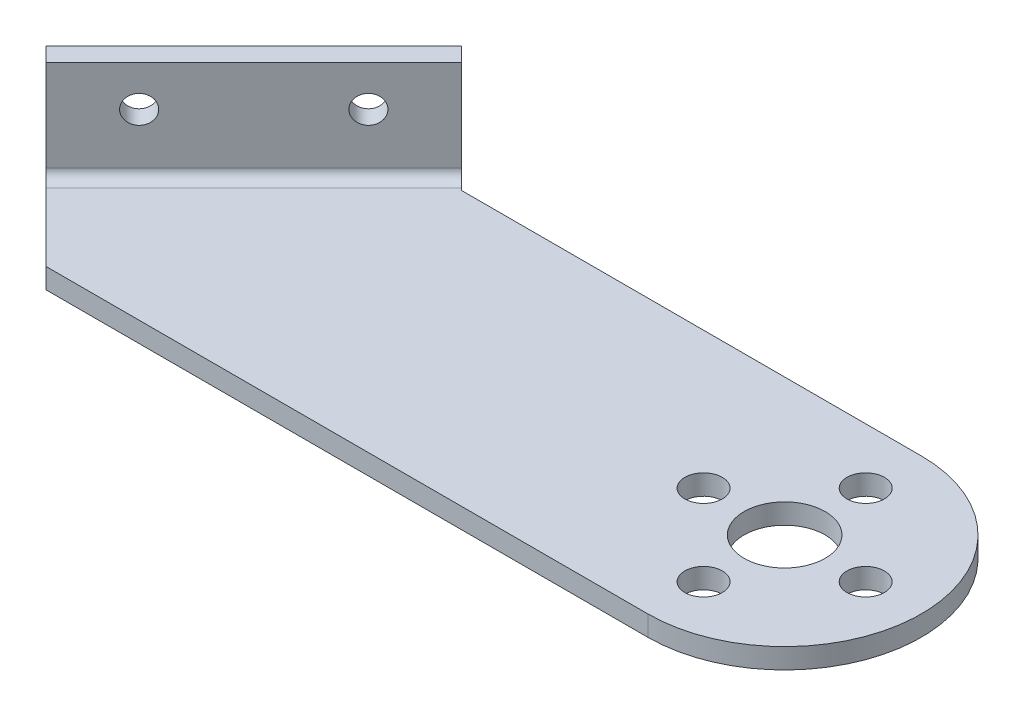
ISO-10303-21;
HEADER;
FILE_DESCRIPTION(('STEP AP214'),'2;1');
FILE_NAME('part.step','',(''),(''),'','','');
FILE_SCHEMA(('AUTOMOTIVE_DESIGN { 1 0 10303 214 1 1 1 1 }'));
ENDSEC;
DATA;
#1=APPLICATION_CONTEXT('core data for automotive mechanical design processes');
#2=APPLICATION_PROTOCOL_DEFINITION('international standard','automotive_design',2000,#1);
#3=PRODUCT_CONTEXT('',#1,'mechanical');
#4=PRODUCT('Part','Part','',(#3));
#5=PRODUCT_RELATED_PRODUCT_CATEGORY('part','',(#4));
#6=PRODUCT_DEFINITION_FORMATION('','',#4);
#7=PRODUCT_DEFINITION_CONTEXT('part definition',#1,'design');
#8=PRODUCT_DEFINITION('design','',#6,#7);
#9=PRODUCT_DEFINITION_SHAPE('','',#8);
#10=(LENGTH_UNIT() NAMED_UNIT(*) SI_UNIT(.MILLI.,.METRE.));
#11=(NAMED_UNIT(*) PLANE_ANGLE_UNIT() SI_UNIT($,.RADIAN.));
#12=(NAMED_UNIT(*) SI_UNIT($,.STERADIAN.) SOLID_ANGLE_UNIT());
#13=UNCERTAINTY_MEASURE_WITH_UNIT(LENGTH_MEASURE(1.E-05),#10,'distance_accuracy_value','');
#14=(GEOMETRIC_REPRESENTATION_CONTEXT(3) GLOBAL_UNCERTAINTY_ASSIGNED_CONTEXT((#13)) GLOBAL_UNIT_ASSIGNED_CONTEXT((#10,
#11,#12)) REPRESENTATION_CONTEXT('',''));
#15=CARTESIAN_POINT('',(0.,0.,0.));
#16=DIRECTION('',(0.,0.,1.));
#17=DIRECTION('',(1.,0.,0.));
#18=AXIS2_PLACEMENT_3D('',#15,#16,#17);
#19=CARTESIAN_POINT('',(13.7940246351911,8.,-9.12741699796952));
#20=DIRECTION('',(-0.707106781186548,0.,-0.707106781186547));
#21=DIRECTION('',(-0.707106781186548,0.,0.707106781186548));
#22=AXIS2_PLACEMENT_3D('',#19,#20,#21);
#23=CYLINDRICAL_SURFACE('',#22,1.36525);
#24=CARTESIAN_POINT('',(11.6727042916315,8.,-11.2487373415292));
#25=DIRECTION('',(-0.707106781186548,0.,-0.707106781186547));
#26=DIRECTION('',(-0.707106781186548,0.,0.707106781186548));
#27=AXIS2_PLACEMENT_3D('',#24,#25,#26);
#28=CIRCLE('',#27,1.36525);
#29=CARTESIAN_POINT('',(10.7073267586166,8.,-10.2833598085142));
#30=VERTEX_POINT('',#29);
#31=EDGE_CURVE('E153',#30,#30,#28,.T.);
#32=ORIENTED_EDGE('',*,*,#31,.T.);
#33=EDGE_LOOP('',(#32));
#34=FACE_BOUND('',#33,.T.);
#35=CARTESIAN_POINT('',(13.0869178540046,8.,-9.83452377915606));
#36=DIRECTION('',(-0.707106781186548,0.,-0.707106781186548));
#37=DIRECTION('',(-0.707106781186548,0.,0.707106781186548));
#38=AXIS2_PLACEMENT_3D('',#35,#36,#37);
#39=CIRCLE('',#38,1.36525);
#40=CARTESIAN_POINT('',(12.1215403209897,8.,-8.86914624614113));
#41=VERTEX_POINT('',#40);
#42=EDGE_CURVE('E195',#41,#41,#39,.T.);
#43=ORIENTED_EDGE('',*,*,#42,.F.);
#44=EDGE_LOOP('',(#43));
#45=FACE_BOUND('',#44,.T.);
#46=ADVANCED_FACE('F38',(#34,#45),#23,.F.);
#47=CARTESIAN_POINT('',(2.48031613620638,8.00000000000001,2.18629150101524));
#48=DIRECTION('',(-0.707106781186548,0.,-0.707106781186547));
#49=DIRECTION('',(-0.707106781186548,0.,0.707106781186548));
#50=AXIS2_PLACEMENT_3D('',#47,#48,#49);
#51=CYLINDRICAL_SURFACE('',#50,1.36525);
#52=CARTESIAN_POINT('',(0.358995792646737,8.00000000000001,0.0649711574556011));
#53=DIRECTION('',(-0.707106781186548,0.,-0.707106781186547));
#54=DIRECTION('',(-0.707106781186548,0.,0.707106781186548));
#55=AXIS2_PLACEMENT_3D('',#52,#53,#54);
#56=CIRCLE('',#55,1.36525);
#57=CARTESIAN_POINT('',(-0.606381740368197,8.00000000000001,1.03034869047054));
#58=VERTEX_POINT('',#57);
#59=EDGE_CURVE('E214',#58,#58,#56,.T.);
#60=ORIENTED_EDGE('',*,*,#59,.T.);
#61=EDGE_LOOP('',(#60));
#62=FACE_BOUND('',#61,.T.);
#63=CARTESIAN_POINT('',(1.77320935501983,8.00000000000001,1.4791847198287));
#64=DIRECTION('',(-0.707106781186548,0.,-0.707106781186548));
#65=DIRECTION('',(-0.707106781186548,0.,0.707106781186548));
#66=AXIS2_PLACEMENT_3D('',#63,#64,#65);
#67=CIRCLE('',#66,1.36525);
#68=CARTESIAN_POINT('',(0.8078318220049,8.00000000000001,2.44456225284363));
#69=VERTEX_POINT('',#68);
#70=EDGE_CURVE('E200',#69,#69,#67,.T.);
#71=ORIENTED_EDGE('',*,*,#70,.F.);
#72=EDGE_LOOP('',(#71));
#73=FACE_BOUND('',#72,.T.);
#74=ADVANCED_FACE('F233',(#62,#73),#51,.F.);
#75=CARTESIAN_POINT('',(70.0090137395217,12.,37.8951839509359));
#76=DIRECTION('',(0.,1.,0.));
#77=DIRECTION('',(-0.707106781186548,0.,0.707106781186548));
#78=AXIS2_PLACEMENT_3D('',#75,#76,#77);
#79=PLANE('',#78);
#80=DIRECTION('',(-0.707106781186548,0.,-0.707106781186548));
#81=VECTOR('',#80,1.);
#82=CARTESIAN_POINT('',(70.0090137395217,12.,37.8951839509359));
#83=LINE('',#82,#81);
#84=CARTESIAN_POINT('',(17.6831119317172,12.,-14.4307178568686));
#85=VERTEX_POINT('',#84);
#86=CARTESIAN_POINT('',(16.2688983693441,12.,-15.8449314192417));
#87=VERTEX_POINT('',#86);
#88=EDGE_CURVE('E212',#85,#87,#83,.T.);
#89=ORIENTED_EDGE('',*,*,#88,.T.);
#90=DIRECTION('',(-0.707106781186547,0.,0.707106781186547));
#91=VECTOR('',#90,1.);
#92=CARTESIAN_POINT('',(16.2688983693441,12.,-15.8449314192417));
#93=LINE('',#92,#91);
#94=CARTESIAN_POINT('',(-4.23719828506582,12.,4.66116523516816));
#95=VERTEX_POINT('',#94);
#96=EDGE_CURVE('E134',#87,#95,#93,.T.);
#97=ORIENTED_EDGE('',*,*,#96,.T.);
#98=DIRECTION('',(-0.707106781186548,0.,-0.707106781186548));
#99=VECTOR('',#98,1.);
#100=CARTESIAN_POINT('',(49.5029170851118,12.,58.4012806053458));
#101=LINE('',#100,#99);
#102=CARTESIAN_POINT('',(-2.82298472269272,12.,6.07537879754126));
#103=VERTEX_POINT('',#102);
#104=EDGE_CURVE('E203',#103,#95,#101,.T.);
#105=ORIENTED_EDGE('',*,*,#104,.F.);
#106=DIRECTION('',(0.707106781186547,0.,-0.707106781186547));
#107=VECTOR('',#106,1.);
#108=CARTESIAN_POINT('',(17.6831119317172,12.,-14.4307178568686));
#109=LINE('',#108,#107);
#110=EDGE_CURVE('E57',#103,#85,#109,.T.);
#111=ORIENTED_EDGE('',*,*,#110,.T.);
#112=EDGE_LOOP('',(#89,#97,#105,#111));
#113=FACE_BOUND('',#112,.T.);
#114=ADVANCED_FACE('F230',(#113),#79,.T.);
#115=CARTESIAN_POINT('',(70.0090137395217,12.,37.8951839509359));
#116=DIRECTION('',(0.707106781186548,0.,-0.707106781186548));
#117=DIRECTION('',(0.,1.,0.));
#118=AXIS2_PLACEMENT_3D('',#115,#116,#117);
#119=PLANE('',#118);
#120=DIRECTION('',(-0.707106781186548,0.,-0.707106781186548));
#121=VECTOR('',#120,1.);
#122=CARTESIAN_POINT('',(70.0090137395217,3.,37.8951839509359));
#123=LINE('',#122,#121);
#124=CARTESIAN_POINT('',(17.6831119317172,3.,-14.4307178568686));
#125=VERTEX_POINT('',#124);
#126=CARTESIAN_POINT('',(16.2688983693441,3.,-15.8449314192417));
#127=VERTEX_POINT('',#126);
#128=EDGE_CURVE('E136',#125,#127,#123,.T.);
#129=ORIENTED_EDGE('',*,*,#128,.T.);
#130=DIRECTION('',(0.,1.,0.));
#131=VECTOR('',#130,1.);
#132=CARTESIAN_POINT('',(16.2688983693441,0.,-15.8449314192417));
#133=LINE('',#132,#131);
#134=EDGE_CURVE('E82',#127,#87,#133,.T.);
#135=ORIENTED_EDGE('',*,*,#134,.T.);
#136=ORIENTED_EDGE('',*,*,#88,.F.);
#137=DIRECTION('',(0.,-1.,0.));
#138=VECTOR('',#137,1.);
#139=CARTESIAN_POINT('',(17.6831119317172,12.,-14.4307178568686));
#140=LINE('',#139,#138);
#141=EDGE_CURVE('E135',#85,#125,#140,.T.);
#142=ORIENTED_EDGE('',*,*,#141,.T.);
#143=EDGE_LOOP('',(#129,#135,#136,#142));
#144=FACE_BOUND('',#143,.T.);
#145=ADVANCED_FACE('F140',(#144),#119,.T.);
#146=CARTESIAN_POINT('',(16.2688983693441,0.,-15.8449314192417));
#147=DIRECTION('',(-0.707106781186547,0.,-0.707106781186548));
#148=DIRECTION('',(-0.707106781186548,0.,0.707106781186548));
#149=AXIS2_PLACEMENT_3D('',#146,#147,#148);
#150=PLANE('',#149);
#151=DIRECTION('',(0.707106781186548,0.,-0.707106781186547));
#152=VECTOR('',#151,1.);
#153=CARTESIAN_POINT('',(16.2688983693441,3.00000000000001,-15.8449314192417));
#154=LINE('',#153,#152);
#155=CARTESIAN_POINT('',(-4.23719828506582,3.,4.66116523516816));
#156=VERTEX_POINT('',#155);
#157=EDGE_CURVE('E76',#156,#127,#154,.T.);
#158=ORIENTED_EDGE('',*,*,#157,.F.);
#159=DIRECTION('',(0.,1.,0.));
#160=VECTOR('',#159,1.);
#161=CARTESIAN_POINT('',(-4.23719828506582,12.,4.66116523516816));
#162=LINE('',#161,#160);
#163=EDGE_CURVE('E205',#156,#95,#162,.T.);
#164=ORIENTED_EDGE('',*,*,#163,.T.);
#165=ORIENTED_EDGE('',*,*,#96,.F.);
#166=ORIENTED_EDGE('',*,*,#134,.F.);
#167=EDGE_LOOP('',(#158,#164,#165,#166));
#168=FACE_BOUND('',#167,.T.);
#169=ORIENTED_EDGE('',*,*,#59,.F.);
#170=EDGE_LOOP('',(#169));
#171=FACE_BOUND('',#170,.T.);
#172=ORIENTED_EDGE('',*,*,#31,.F.);
#173=EDGE_LOOP('',(#172));
#174=FACE_BOUND('',#173,.T.);
#175=ADVANCED_FACE('F131',(#168,#171,#174),#150,.T.);
#176=CARTESIAN_POINT('',(49.5029170851118,12.,58.4012806053458));
#177=DIRECTION('',(0.707106781186548,0.,-0.707106781186548));
#178=DIRECTION('',(0.,1.,0.));
#179=AXIS2_PLACEMENT_3D('',#176,#177,#178);
#180=PLANE('',#179);
#181=ORIENTED_EDGE('',*,*,#163,.F.);
#182=DIRECTION('',(-0.707106781186548,0.,-0.707106781186548));
#183=VECTOR('',#182,1.);
#184=CARTESIAN_POINT('',(49.5029170851118,3.,58.4012806053458));
#185=LINE('',#184,#183);
#186=CARTESIAN_POINT('',(-2.82298472269272,2.99999999999999,6.07537879754126));
#187=VERTEX_POINT('',#186);
#188=EDGE_CURVE('E42',#187,#156,#185,.T.);
#189=ORIENTED_EDGE('',*,*,#188,.F.);
#190=DIRECTION('',(0.,-1.,0.));
#191=VECTOR('',#190,1.);
#192=CARTESIAN_POINT('',(-2.82298472269272,12.,6.07537879754126));
#193=LINE('',#192,#191);
#194=EDGE_CURVE('E48',#103,#187,#193,.T.);
#195=ORIENTED_EDGE('',*,*,#194,.F.);
#196=ORIENTED_EDGE('',*,*,#104,.T.);
#197=EDGE_LOOP('',(#181,#189,#195,#196));
#198=FACE_BOUND('',#197,.T.);
#199=ADVANCED_FACE('F223',(#198),#180,.F.);
#200=CARTESIAN_POINT('',(17.6831119317172,12.,-14.4307178568686));
#201=DIRECTION('',(-0.707106781186548,0.,-0.707106781186548));
#202=DIRECTION('',(-0.707106781186548,0.,0.707106781186548));
#203=AXIS2_PLACEMENT_3D('',#200,#201,#202);
#204=PLANE('',#203);
#205=ORIENTED_EDGE('',*,*,#70,.T.);
#206=EDGE_LOOP('',(#205));
#207=FACE_BOUND('',#206,.T.);
#208=ORIENTED_EDGE('',*,*,#42,.T.);
#209=EDGE_LOOP('',(#208));
#210=FACE_BOUND('',#209,.T.);
#211=ORIENTED_EDGE('',*,*,#194,.T.);
#212=DIRECTION('',(0.707106781186548,0.,-0.707106781186548));
#213=VECTOR('',#212,1.);
#214=CARTESIAN_POINT('',(17.6831119317172,3.,-14.4307178568686));
#215=LINE('',#214,#213);
#216=EDGE_CURVE('E11',#187,#125,#215,.T.);
#217=ORIENTED_EDGE('',*,*,#216,.T.);
#218=ORIENTED_EDGE('',*,*,#141,.F.);
#219=ORIENTED_EDGE('',*,*,#110,.F.);
#220=EDGE_LOOP('',(#211,#217,#218,#219));
#221=FACE_BOUND('',#220,.T.);
#222=ADVANCED_FACE('F40',(#207,#210,#221),#204,.F.);
#223=CARTESIAN_POINT('',(64.,0.,0.));
#224=DIRECTION('',(0.,1.,0.));
#225=DIRECTION('',(0.,0.,1.));
#226=AXIS2_PLACEMENT_3D('',#223,#224,#225);
#227=PLANE('',#226);
#228=CARTESIAN_POINT('',(56.,0.,0.));
#229=DIRECTION('',(0.,1.,0.));
#230=DIRECTION('',(0.,0.,-1.));
#231=AXIS2_PLACEMENT_3D('',#228,#229,#230);
#232=CIRCLE('',#231,1.85);
#233=CARTESIAN_POINT('',(56.,0.,-1.85));
#234=VERTEX_POINT('',#233);
#235=EDGE_CURVE('E278',#234,#234,#232,.T.);
#236=ORIENTED_EDGE('',*,*,#235,.T.);
#237=EDGE_LOOP('',(#236));
#238=FACE_BOUND('',#237,.T.);
#239=CARTESIAN_POINT('',(64.,0.,8.));
#240=DIRECTION('',(0.,1.,0.));
#241=DIRECTION('',(0.,0.,-1.));
#242=AXIS2_PLACEMENT_3D('',#239,#240,#241);
#243=CIRCLE('',#242,1.85);
#244=CARTESIAN_POINT('',(64.,0.,6.15));
#245=VERTEX_POINT('',#244);
#246=EDGE_CURVE('E359',#245,#245,#243,.T.);
#247=ORIENTED_EDGE('',*,*,#246,.T.);
#248=EDGE_LOOP('',(#247));
#249=FACE_BOUND('',#248,.T.);
#250=CARTESIAN_POINT('',(72.,0.,0.));
#251=DIRECTION('',(0.,1.,0.));
#252=DIRECTION('',(0.,0.,-1.));
#253=AXIS2_PLACEMENT_3D('',#250,#251,#252);
#254=CIRCLE('',#253,1.85);
#255=CARTESIAN_POINT('',(72.,0.,-1.85));
#256=VERTEX_POINT('',#255);
#257=EDGE_CURVE('E356',#256,#256,#254,.T.);
#258=ORIENTED_EDGE('',*,*,#257,.T.);
#259=EDGE_LOOP('',(#258));
#260=FACE_BOUND('',#259,.T.);
#261=CARTESIAN_POINT('',(64.,0.,-8.));
#262=DIRECTION('',(0.,1.,0.));
#263=DIRECTION('',(0.,0.,-1.));
#264=AXIS2_PLACEMENT_3D('',#261,#262,#263);
#265=CIRCLE('',#264,1.85);
#266=CARTESIAN_POINT('',(64.,0.,-9.85));
#267=VERTEX_POINT('',#266);
#268=EDGE_CURVE('E347',#267,#267,#265,.T.);
#269=ORIENTED_EDGE('',*,*,#268,.T.);
#270=EDGE_LOOP('',(#269));
#271=FACE_BOUND('',#270,.T.);
#272=CARTESIAN_POINT('',(64.,0.,0.));
#273=DIRECTION('',(0.,1.,0.));
#274=DIRECTION('',(0.,0.,-1.));
#275=AXIS2_PLACEMENT_3D('',#272,#273,#274);
#276=CIRCLE('',#275,4.);
#277=CARTESIAN_POINT('',(64.,0.,-4.));
#278=VERTEX_POINT('',#277);
#279=EDGE_CURVE('E343',#278,#278,#276,.T.);
#280=ORIENTED_EDGE('',*,*,#279,.T.);
#281=EDGE_LOOP('',(#280));
#282=FACE_BOUND('',#281,.T.);
#283=DIRECTION('',(-0.707106781186547,0.,0.707106781186548));
#284=VECTOR('',#283,1.);
#285=CARTESIAN_POINT('',(18.3902187129037,0.,-13.7236110756821));
#286=LINE('',#285,#284);
#287=CARTESIAN_POINT('',(18.3902187129037,0.,-13.7236110756821));
#288=VERTEX_POINT('',#287);
#289=CARTESIAN_POINT('',(-2.11587794150617,0.,6.78248557872781));
#290=VERTEX_POINT('',#289);
#291=EDGE_CURVE('E178',#288,#290,#286,.T.);
#292=ORIENTED_EDGE('',*,*,#291,.F.);
#293=DIRECTION('',(-0.707106781186547,0.,-0.707106781186548));
#294=VECTOR('',#293,1.);
#295=CARTESIAN_POINT('',(18.6138297885858,0.,-13.5));
#296=LINE('',#295,#294);
#297=CARTESIAN_POINT('',(18.6138297885858,0.,-13.5));
#298=VERTEX_POINT('',#297);
#299=EDGE_CURVE('E270',#298,#288,#296,.T.);
#300=ORIENTED_EDGE('',*,*,#299,.F.);
#301=DIRECTION('',(-1.,0.,0.));
#302=VECTOR('',#301,1.);
#303=CARTESIAN_POINT('',(64.,0.,-13.5));
#304=LINE('',#303,#302);
#305=CARTESIAN_POINT('',(64.,0.,-13.5));
#306=VERTEX_POINT('',#305);
#307=EDGE_CURVE('E273',#306,#298,#304,.T.);
#308=ORIENTED_EDGE('',*,*,#307,.F.);
#309=CARTESIAN_POINT('',(64.,0.,0.));
#310=DIRECTION('',(0.,1.,0.));
#311=DIRECTION('',(0.,0.,1.));
#312=AXIS2_PLACEMENT_3D('',#309,#310,#311);
#313=CIRCLE('',#312,13.5);
#314=CARTESIAN_POINT('',(64.,0.,13.5));
#315=VERTEX_POINT('',#314);
#316=EDGE_CURVE('E276',#315,#306,#313,.T.);
#317=ORIENTED_EDGE('',*,*,#316,.F.);
#318=DIRECTION('',(1.,0.,0.));
#319=VECTOR('',#318,1.);
#320=CARTESIAN_POINT('',(4.60163647976604,0.,13.5));
#321=LINE('',#320,#319);
#322=CARTESIAN_POINT('',(4.60163647976604,0.,13.5));
#323=VERTEX_POINT('',#322);
#324=EDGE_CURVE('E173',#323,#315,#321,.T.);
#325=ORIENTED_EDGE('',*,*,#324,.F.);
#326=DIRECTION('',(0.707106781186548,0.,0.707106781186547));
#327=VECTOR('',#326,1.);
#328=CARTESIAN_POINT('',(-4.23719828506582,0.,4.66116523516815));
#329=LINE('',#328,#327);
#330=EDGE_CURVE('E274',#290,#323,#329,.T.);
#331=ORIENTED_EDGE('',*,*,#330,.F.);
#332=EDGE_LOOP('',(#292,#300,#308,#317,#325,#331));
#333=FACE_BOUND('',#332,.T.);
#334=ADVANCED_FACE('F319',(#238,#249,#260,#271,#282,#333),#227,.F.);
#335=CARTESIAN_POINT('',(64.,2.,0.));
#336=DIRECTION('',(0.,1.,0.));
#337=DIRECTION('',(0.,0.,1.));
#338=AXIS2_PLACEMENT_3D('',#335,#336,#337);
#339=PLANE('',#338);
#340=CARTESIAN_POINT('',(64.,2.,0.));
#341=DIRECTION('',(0.,1.,0.));
#342=DIRECTION('',(0.,0.,-1.));
#343=AXIS2_PLACEMENT_3D('',#340,#341,#342);
#344=CIRCLE('',#343,4.);
#345=CARTESIAN_POINT('',(64.,2.,-4.));
#346=VERTEX_POINT('',#345);
#347=EDGE_CURVE('E373',#346,#346,#344,.T.);
#348=ORIENTED_EDGE('',*,*,#347,.F.);
#349=EDGE_LOOP('',(#348));
#350=FACE_BOUND('',#349,.T.);
#351=CARTESIAN_POINT('',(64.,2.,-8.));
#352=DIRECTION('',(0.,1.,0.));
#353=DIRECTION('',(0.,0.,-1.));
#354=AXIS2_PLACEMENT_3D('',#351,#352,#353);
#355=CIRCLE('',#354,1.85);
#356=CARTESIAN_POINT('',(64.,2.,-9.85));
#357=VERTEX_POINT('',#356);
#358=EDGE_CURVE('E371',#357,#357,#355,.T.);
#359=ORIENTED_EDGE('',*,*,#358,.F.);
#360=EDGE_LOOP('',(#359));
#361=FACE_BOUND('',#360,.T.);
#362=CARTESIAN_POINT('',(72.,2.,0.));
#363=DIRECTION('',(0.,1.,0.));
#364=DIRECTION('',(0.,0.,-1.));
#365=AXIS2_PLACEMENT_3D('',#362,#363,#364);
#366=CIRCLE('',#365,1.85);
#367=CARTESIAN_POINT('',(72.,2.,-1.85));
#368=VERTEX_POINT('',#367);
#369=EDGE_CURVE('E350',#368,#368,#366,.T.);
#370=ORIENTED_EDGE('',*,*,#369,.F.);
#371=EDGE_LOOP('',(#370));
#372=FACE_BOUND('',#371,.T.);
#373=CARTESIAN_POINT('',(64.,2.,8.));
#374=DIRECTION('',(0.,1.,0.));
#375=DIRECTION('',(0.,0.,-1.));
#376=AXIS2_PLACEMENT_3D('',#373,#374,#375);
#377=CIRCLE('',#376,1.85);
#378=CARTESIAN_POINT('',(64.,2.,6.15));
#379=VERTEX_POINT('',#378);
#380=EDGE_CURVE('E344',#379,#379,#377,.T.);
#381=ORIENTED_EDGE('',*,*,#380,.F.);
#382=EDGE_LOOP('',(#381));
#383=FACE_BOUND('',#382,.T.);
#384=CARTESIAN_POINT('',(56.,2.,0.));
#385=DIRECTION('',(0.,1.,0.));
#386=DIRECTION('',(0.,0.,-1.));
#387=AXIS2_PLACEMENT_3D('',#384,#385,#386);
#388=CIRCLE('',#387,1.85);
#389=CARTESIAN_POINT('',(56.,2.,-1.85));
#390=VERTEX_POINT('',#389);
#391=EDGE_CURVE('E341',#390,#390,#388,.T.);
#392=ORIENTED_EDGE('',*,*,#391,.F.);
#393=EDGE_LOOP('',(#392));
#394=FACE_BOUND('',#393,.T.);
#395=DIRECTION('',(-0.707106781186547,0.,-0.707106781186548));
#396=VECTOR('',#395,1.);
#397=CARTESIAN_POINT('',(18.6138297885858,2.,-13.5));
#398=LINE('',#397,#396);
#399=CARTESIAN_POINT('',(18.6138297885858,2.,-13.5));
#400=VERTEX_POINT('',#399);
#401=CARTESIAN_POINT('',(18.3902187129037,2.,-13.7236110756821));
#402=VERTEX_POINT('',#401);
#403=EDGE_CURVE('E267',#400,#402,#398,.T.);
#404=ORIENTED_EDGE('',*,*,#403,.T.);
#405=DIRECTION('',(-0.707106781186547,0.,0.707106781186548));
#406=VECTOR('',#405,1.);
#407=CARTESIAN_POINT('',(18.3902187129037,2.,-13.7236110756821));
#408=LINE('',#407,#406);
#409=CARTESIAN_POINT('',(-2.11587794150617,2.,6.7824855787278));
#410=VERTEX_POINT('',#409);
#411=EDGE_CURVE('E175',#402,#410,#408,.T.);
#412=ORIENTED_EDGE('',*,*,#411,.T.);
#413=DIRECTION('',(0.707106781186548,0.,0.707106781186547));
#414=VECTOR('',#413,1.);
#415=CARTESIAN_POINT('',(-4.23719828506582,2.,4.66116523516815));
#416=LINE('',#415,#414);
#417=CARTESIAN_POINT('',(4.60163647976604,2.00000000000006,13.5));
#418=VERTEX_POINT('',#417);
#419=EDGE_CURVE('E159',#410,#418,#416,.T.);
#420=ORIENTED_EDGE('',*,*,#419,.T.);
#421=DIRECTION('',(1.,0.,0.));
#422=VECTOR('',#421,1.);
#423=CARTESIAN_POINT('',(4.60163647976604,2.,13.5));
#424=LINE('',#423,#422);
#425=CARTESIAN_POINT('',(64.,2.00000000000006,13.5));
#426=VERTEX_POINT('',#425);
#427=EDGE_CURVE('E90',#418,#426,#424,.T.);
#428=ORIENTED_EDGE('',*,*,#427,.T.);
#429=CARTESIAN_POINT('',(64.,2.,0.));
#430=DIRECTION('',(0.,1.,0.));
#431=DIRECTION('',(0.,0.,1.));
#432=AXIS2_PLACEMENT_3D('',#429,#430,#431);
#433=CIRCLE('',#432,13.5);
#434=CARTESIAN_POINT('',(64.,2.00000000000006,-13.5));
#435=VERTEX_POINT('',#434);
#436=EDGE_CURVE('E98',#426,#435,#433,.T.);
#437=ORIENTED_EDGE('',*,*,#436,.T.);
#438=DIRECTION('',(-1.,0.,0.));
#439=VECTOR('',#438,1.);
#440=CARTESIAN_POINT('',(64.,2.,-13.5));
#441=LINE('',#440,#439);
#442=EDGE_CURVE('E382',#435,#400,#441,.T.);
#443=ORIENTED_EDGE('',*,*,#442,.T.);
#444=EDGE_LOOP('',(#404,#412,#420,#428,#437,#443));
#445=FACE_BOUND('',#444,.T.);
#446=ADVANCED_FACE('F264',(#350,#361,#372,#383,#394,#445),#339,.T.);
#447=CARTESIAN_POINT('',(56.,0.,0.));
#448=DIRECTION('',(0.,1.,0.));
#449=DIRECTION('',(0.,0.,1.));
#450=AXIS2_PLACEMENT_3D('',#447,#448,#449);
#451=CYLINDRICAL_SURFACE('',#450,1.85);
#452=ORIENTED_EDGE('',*,*,#235,.F.);
#453=EDGE_LOOP('',(#452));
#454=FACE_BOUND('',#453,.T.);
#455=ORIENTED_EDGE('',*,*,#391,.T.);
#456=EDGE_LOOP('',(#455));
#457=FACE_BOUND('',#456,.T.);
#458=ADVANCED_FACE('F328',(#454,#457),#451,.F.);
#459=CARTESIAN_POINT('',(64.,0.,8.));
#460=DIRECTION('',(0.,1.,0.));
#461=DIRECTION('',(0.,0.,1.));
#462=AXIS2_PLACEMENT_3D('',#459,#460,#461);
#463=CYLINDRICAL_SURFACE('',#462,1.85);
#464=ORIENTED_EDGE('',*,*,#246,.F.);
#465=EDGE_LOOP('',(#464));
#466=FACE_BOUND('',#465,.T.);
#467=ORIENTED_EDGE('',*,*,#380,.T.);
#468=EDGE_LOOP('',(#467));
#469=FACE_BOUND('',#468,.T.);
#470=ADVANCED_FACE('F325',(#466,#469),#463,.F.);
#471=CARTESIAN_POINT('',(72.,0.,0.));
#472=DIRECTION('',(0.,1.,0.));
#473=DIRECTION('',(0.,0.,1.));
#474=AXIS2_PLACEMENT_3D('',#471,#472,#473);
#475=CYLINDRICAL_SURFACE('',#474,1.85);
#476=ORIENTED_EDGE('',*,*,#257,.F.);
#477=EDGE_LOOP('',(#476));
#478=FACE_BOUND('',#477,.T.);
#479=ORIENTED_EDGE('',*,*,#369,.T.);
#480=EDGE_LOOP('',(#479));
#481=FACE_BOUND('',#480,.T.);
#482=ADVANCED_FACE('F311',(#478,#481),#475,.F.);
#483=CARTESIAN_POINT('',(64.,0.,-8.));
#484=DIRECTION('',(0.,1.,0.));
#485=DIRECTION('',(0.,0.,1.));
#486=AXIS2_PLACEMENT_3D('',#483,#484,#485);
#487=CYLINDRICAL_SURFACE('',#486,1.85);
#488=ORIENTED_EDGE('',*,*,#268,.F.);
#489=EDGE_LOOP('',(#488));
#490=FACE_BOUND('',#489,.T.);
#491=ORIENTED_EDGE('',*,*,#358,.T.);
#492=EDGE_LOOP('',(#491));
#493=FACE_BOUND('',#492,.T.);
#494=ADVANCED_FACE('F305',(#490,#493),#487,.F.);
#495=CARTESIAN_POINT('',(64.,0.,0.));
#496=DIRECTION('',(0.,1.,0.));
#497=DIRECTION('',(0.,0.,1.));
#498=AXIS2_PLACEMENT_3D('',#495,#496,#497);
#499=CYLINDRICAL_SURFACE('',#498,4.);
#500=ORIENTED_EDGE('',*,*,#279,.F.);
#501=EDGE_LOOP('',(#500));
#502=FACE_BOUND('',#501,.T.);
#503=ORIENTED_EDGE('',*,*,#347,.T.);
#504=EDGE_LOOP('',(#503));
#505=FACE_BOUND('',#504,.T.);
#506=ADVANCED_FACE('F301',(#502,#505),#499,.F.);
#507=CARTESIAN_POINT('',(18.6138297885858,168.283249557367,-13.5));
#508=DIRECTION('',(-0.707106781186548,0.,0.707106781186547));
#509=DIRECTION('',(0.707106781186547,0.,0.707106781186548));
#510=AXIS2_PLACEMENT_3D('',#507,#508,#509);
#511=PLANE('',#510);
#512=DIRECTION('',(0.,-1.,0.));
#513=VECTOR('',#512,1.);
#514=CARTESIAN_POINT('',(18.6138297885858,168.283249557367,-13.5));
#515=LINE('',#514,#513);
#516=EDGE_CURVE('E180',#400,#298,#515,.T.);
#517=ORIENTED_EDGE('',*,*,#516,.T.);
#518=ORIENTED_EDGE('',*,*,#299,.T.);
#519=DIRECTION('',(0.,-1.,0.));
#520=VECTOR('',#519,1.);
#521=CARTESIAN_POINT('',(18.3902187129037,168.283249557367,-13.7236110756821));
#522=LINE('',#521,#520);
#523=EDGE_CURVE('E156',#402,#288,#522,.T.);
#524=ORIENTED_EDGE('',*,*,#523,.F.);
#525=ORIENTED_EDGE('',*,*,#403,.F.);
#526=EDGE_LOOP('',(#517,#518,#524,#525));
#527=FACE_BOUND('',#526,.T.);
#528=ADVANCED_FACE('F241',(#527),#511,.F.);
#529=CARTESIAN_POINT('',(-4.23719828506582,168.283249557367,4.66116523516815));
#530=DIRECTION('',(0.707106781186547,0.,-0.707106781186548));
#531=DIRECTION('',(-0.707106781186548,0.,-0.707106781186547));
#532=AXIS2_PLACEMENT_3D('',#529,#530,#531);
#533=PLANE('',#532);
#534=DIRECTION('',(0.,-1.,0.));
#535=VECTOR('',#534,1.);
#536=CARTESIAN_POINT('',(-2.11587794150617,168.283249557367,6.7824855787278));
#537=LINE('',#536,#535);
#538=EDGE_CURVE('E190',#410,#290,#537,.T.);
#539=ORIENTED_EDGE('',*,*,#538,.T.);
#540=ORIENTED_EDGE('',*,*,#330,.T.);
#541=DIRECTION('',(0.,-1.,0.));
#542=VECTOR('',#541,1.);
#543=CARTESIAN_POINT('',(4.60163647976604,168.283249557367,13.5));
#544=LINE('',#543,#542);
#545=EDGE_CURVE('E188',#418,#323,#544,.T.);
#546=ORIENTED_EDGE('',*,*,#545,.F.);
#547=ORIENTED_EDGE('',*,*,#419,.F.);
#548=EDGE_LOOP('',(#539,#540,#546,#547));
#549=FACE_BOUND('',#548,.T.);
#550=ADVANCED_FACE('F261',(#549),#533,.F.);
#551=CARTESIAN_POINT('',(4.60163647976604,168.283249557367,13.5));
#552=DIRECTION('',(0.,0.,-1.));
#553=DIRECTION('',(-1.,0.,0.));
#554=AXIS2_PLACEMENT_3D('',#551,#552,#553);
#555=PLANE('',#554);
#556=ORIENTED_EDGE('',*,*,#545,.T.);
#557=ORIENTED_EDGE('',*,*,#324,.T.);
#558=DIRECTION('',(0.,-1.,0.));
#559=VECTOR('',#558,1.);
#560=CARTESIAN_POINT('',(64.,168.283249557367,13.5));
#561=LINE('',#560,#559);
#562=EDGE_CURVE('E186',#426,#315,#561,.T.);
#563=ORIENTED_EDGE('',*,*,#562,.F.);
#564=ORIENTED_EDGE('',*,*,#427,.F.);
#565=EDGE_LOOP('',(#556,#557,#563,#564));
#566=FACE_BOUND('',#565,.T.);
#567=ADVANCED_FACE('F283',(#566),#555,.F.);
#568=CARTESIAN_POINT('',(64.,168.283249557367,0.));
#569=DIRECTION('',(0.,-1.,0.));
#570=DIRECTION('',(0.,0.,-1.));
#571=AXIS2_PLACEMENT_3D('',#568,#569,#570);
#572=CYLINDRICAL_SURFACE('',#571,13.5);
#573=ORIENTED_EDGE('',*,*,#562,.T.);
#574=ORIENTED_EDGE('',*,*,#316,.T.);
#575=DIRECTION('',(0.,-1.,0.));
#576=VECTOR('',#575,1.);
#577=CARTESIAN_POINT('',(64.,168.283249557367,-13.5));
#578=LINE('',#577,#576);
#579=EDGE_CURVE('E183',#435,#306,#578,.T.);
#580=ORIENTED_EDGE('',*,*,#579,.F.);
#581=ORIENTED_EDGE('',*,*,#436,.F.);
#582=EDGE_LOOP('',(#573,#574,#580,#581));
#583=FACE_BOUND('',#582,.T.);
#584=ADVANCED_FACE('F285',(#583),#572,.T.);
#585=CARTESIAN_POINT('',(64.,168.283249557367,-13.5));
#586=DIRECTION('',(0.,0.,1.));
#587=DIRECTION('',(1.,0.,0.));
#588=AXIS2_PLACEMENT_3D('',#585,#586,#587);
#589=PLANE('',#588);
#590=ORIENTED_EDGE('',*,*,#579,.T.);
#591=ORIENTED_EDGE('',*,*,#307,.T.);
#592=ORIENTED_EDGE('',*,*,#516,.F.);
#593=ORIENTED_EDGE('',*,*,#442,.F.);
#594=EDGE_LOOP('',(#590,#591,#592,#593));
#595=FACE_BOUND('',#594,.T.);
#596=ADVANCED_FACE('F287',(#595),#589,.F.);
#597=CARTESIAN_POINT('',(-2.11587794150618,3.,6.78248557872782));
#598=DIRECTION('',(-0.707106781186547,0.,0.707106781186549));
#599=DIRECTION('',(0.707106781186549,0.,0.707106781186547));
#600=AXIS2_PLACEMENT_3D('',#597,#598,#599);
#601=PLANE('',#600);
#602=ORIENTED_EDGE('',*,*,#538,.F.);
#603=CARTESIAN_POINT('',(-2.11587794150617,3.,6.78248557872781));
#604=DIRECTION('',(-0.707106781186547,0.,0.707106781186547));
#605=DIRECTION('',(0.707106781186548,0.,0.707106781186548));
#606=AXIS2_PLACEMENT_3D('',#603,#604,#605);
#607=CIRCLE('',#606,1.);
#608=EDGE_CURVE('E157',#410,#187,#607,.F.);
#609=ORIENTED_EDGE('',*,*,#608,.T.);
#610=ORIENTED_EDGE('',*,*,#188,.T.);
#611=CARTESIAN_POINT('',(-2.11587794150617,3.,6.78248557872781));
#612=DIRECTION('',(-0.707106781186547,0.,0.707106781186547));
#613=DIRECTION('',(0.707106781186548,0.,0.707106781186548));
#614=AXIS2_PLACEMENT_3D('',#611,#612,#613);
#615=CIRCLE('',#614,3.);
#616=EDGE_CURVE('E152',#290,#156,#615,.F.);
#617=ORIENTED_EDGE('',*,*,#616,.F.);
#618=EDGE_LOOP('',(#602,#609,#610,#617));
#619=FACE_BOUND('',#618,.T.);
#620=ADVANCED_FACE('F257',(#619),#601,.T.);
#621=CARTESIAN_POINT('',(18.3902187129037,3.,-13.7236110756821));
#622=DIRECTION('',(0.707106781186549,0.,-0.707106781186547));
#623=DIRECTION('',(-0.707106781186547,0.,-0.707106781186549));
#624=AXIS2_PLACEMENT_3D('',#621,#622,#623);
#625=PLANE('',#624);
#626=ORIENTED_EDGE('',*,*,#128,.F.);
#627=CARTESIAN_POINT('',(18.3902187129037,3.,-13.7236110756821));
#628=DIRECTION('',(-0.707106781186547,0.,0.707106781186547));
#629=DIRECTION('',(0.707106781186548,0.,0.707106781186548));
#630=AXIS2_PLACEMENT_3D('',#627,#628,#629);
#631=CIRCLE('',#630,1.);
#632=EDGE_CURVE('E162',#125,#402,#631,.T.);
#633=ORIENTED_EDGE('',*,*,#632,.T.);
#634=ORIENTED_EDGE('',*,*,#523,.T.);
#635=CARTESIAN_POINT('',(18.3902187129037,3.,-13.7236110756821));
#636=DIRECTION('',(-0.707106781186547,0.,0.707106781186547));
#637=DIRECTION('',(0.707106781186548,0.,0.707106781186548));
#638=AXIS2_PLACEMENT_3D('',#635,#636,#637);
#639=CIRCLE('',#638,3.);
#640=EDGE_CURVE('E150',#127,#288,#639,.T.);
#641=ORIENTED_EDGE('',*,*,#640,.F.);
#642=EDGE_LOOP('',(#626,#633,#634,#641));
#643=FACE_BOUND('',#642,.T.);
#644=ADVANCED_FACE('F154',(#643),#625,.T.);
#645=CARTESIAN_POINT('',(85.4305420946151,3.,-80.7639344573934));
#646=DIRECTION('',(-0.707106781186547,0.,0.707106781186547));
#647=DIRECTION('',(0.707106781186548,0.,0.707106781186548));
#648=AXIS2_PLACEMENT_3D('',#645,#646,#647);
#649=CYLINDRICAL_SURFACE('',#648,3.);
#650=ORIENTED_EDGE('',*,*,#640,.T.);
#651=ORIENTED_EDGE('',*,*,#291,.T.);
#652=ORIENTED_EDGE('',*,*,#616,.T.);
#653=ORIENTED_EDGE('',*,*,#157,.T.);
#654=EDGE_LOOP('',(#650,#651,#652,#653));
#655=FACE_BOUND('',#654,.T.);
#656=ADVANCED_FACE('F148',(#655),#649,.T.);
#657=CARTESIAN_POINT('',(85.4305420946151,3.,-80.7639344573934));
#658=DIRECTION('',(-0.707106781186547,0.,0.707106781186547));
#659=DIRECTION('',(0.707106781186548,0.,0.707106781186548));
#660=AXIS2_PLACEMENT_3D('',#657,#658,#659);
#661=CYLINDRICAL_SURFACE('',#660,1.);
#662=ORIENTED_EDGE('',*,*,#632,.F.);
#663=ORIENTED_EDGE('',*,*,#216,.F.);
#664=ORIENTED_EDGE('',*,*,#608,.F.);
#665=ORIENTED_EDGE('',*,*,#411,.F.);
#666=EDGE_LOOP('',(#662,#663,#664,#665));
#667=FACE_BOUND('',#666,.T.);
#668=ADVANCED_FACE('F253',(#667),#661,.F.);
#669=CLOSED_SHELL('',(#46,#74,#114,#145,#175,#199,#222,#334,#446,#458,#470,#482,#494,#506,#528,
#550,#567,#584,#596,#620,#644,#656,#668));
#670=MANIFOLD_SOLID_BREP('B2',#669);
#671=ADVANCED_BREP_SHAPE_REPRESENTATION('',(#18,#670),#14);
#672=SHAPE_DEFINITION_REPRESENTATION(#9,#671);
ENDSEC;
END-ISO-10303-21;
